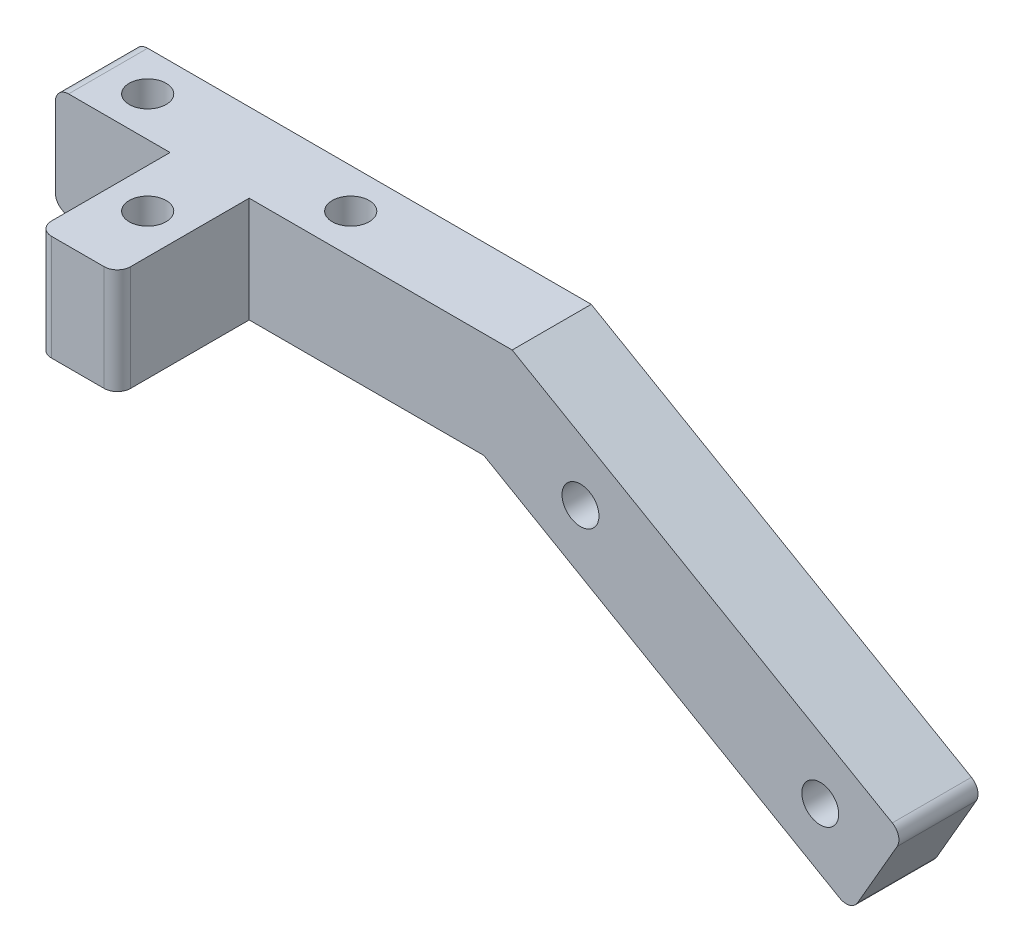
ISO-10303-21;
HEADER;
FILE_DESCRIPTION(('STEP AP214'),'2;1');
FILE_NAME('part.step','',(''),(''),'','','');
FILE_SCHEMA(('AUTOMOTIVE_DESIGN { 1 0 10303 214 1 1 1 1 }'));
ENDSEC;
DATA;
#1=APPLICATION_CONTEXT('core data for automotive mechanical design processes');
#2=APPLICATION_PROTOCOL_DEFINITION('international standard','automotive_design',2000,#1);
#3=PRODUCT_CONTEXT('',#1,'mechanical');
#4=PRODUCT('Part','Part','',(#3));
#5=PRODUCT_RELATED_PRODUCT_CATEGORY('part','',(#4));
#6=PRODUCT_DEFINITION_FORMATION('','',#4);
#7=PRODUCT_DEFINITION_CONTEXT('part definition',#1,'design');
#8=PRODUCT_DEFINITION('design','',#6,#7);
#9=PRODUCT_DEFINITION_SHAPE('','',#8);
#10=(LENGTH_UNIT() NAMED_UNIT(*) SI_UNIT(.MILLI.,.METRE.));
#11=(NAMED_UNIT(*) PLANE_ANGLE_UNIT() SI_UNIT($,.RADIAN.));
#12=(NAMED_UNIT(*) SI_UNIT($,.STERADIAN.) SOLID_ANGLE_UNIT());
#13=UNCERTAINTY_MEASURE_WITH_UNIT(LENGTH_MEASURE(1.E-05),#10,'distance_accuracy_value','');
#14=(GEOMETRIC_REPRESENTATION_CONTEXT(3) GLOBAL_UNCERTAINTY_ASSIGNED_CONTEXT((#13)) GLOBAL_UNIT_ASSIGNED_CONTEXT((#10,
#11,#12)) REPRESENTATION_CONTEXT('',''));
#15=CARTESIAN_POINT('',(0.,0.,0.));
#16=DIRECTION('',(0.,0.,1.));
#17=DIRECTION('',(1.,0.,0.));
#18=AXIS2_PLACEMENT_3D('',#15,#16,#17);
#19=CARTESIAN_POINT('',(0.,0.,7.62));
#20=DIRECTION('',(0.,0.,-1.));
#21=DIRECTION('',(-1.,0.,0.));
#22=AXIS2_PLACEMENT_3D('',#19,#20,#21);
#23=PLANE('',#22);
#24=CARTESIAN_POINT('',(50.5786359259566,0.494422028673305,7.62));
#25=DIRECTION('',(0.,0.,1.));
#26=DIRECTION('',(1.,0.,0.));
#27=AXIS2_PLACEMENT_3D('',#24,#25,#26);
#28=CIRCLE('',#27,1.778);
#29=CARTESIAN_POINT('',(52.3566359259566,0.494422028673305,7.62));
#30=VERTEX_POINT('',#29);
#31=EDGE_CURVE('E197',#30,#30,#28,.T.);
#32=ORIENTED_EDGE('',*,*,#31,.F.);
#33=EDGE_LOOP('',(#32));
#34=FACE_BOUND('',#33,.T.);
#35=CARTESIAN_POINT('',(73.6755334448875,-12.8405779713267,7.62));
#36=DIRECTION('',(0.,0.,1.));
#37=DIRECTION('',(1.,0.,0.));
#38=AXIS2_PLACEMENT_3D('',#35,#36,#37);
#39=CIRCLE('',#38,1.77800000000001);
#40=CARTESIAN_POINT('',(75.4535334448875,-12.8405779713267,7.62));
#41=VERTEX_POINT('',#40);
#42=EDGE_CURVE('E453',#41,#41,#39,.T.);
#43=ORIENTED_EDGE('',*,*,#42,.F.);
#44=EDGE_LOOP('',(#43));
#45=FACE_BOUND('',#44,.T.);
#46=DIRECTION('',(0.5,0.866025403784438,0.));
#47=VECTOR('',#46,1.);
#48=CARTESIAN_POINT('',(81.7147947589187,-11.6161689201018,7.62));
#49=LINE('',#48,#47);
#50=CARTESIAN_POINT('',(77.2697947589187,-19.3151347597454,7.62));
#51=VERTEX_POINT('',#50);
#52=CARTESIAN_POINT('',(81.0797947589187,-12.716021182908,7.62));
#53=VERTEX_POINT('',#52);
#54=EDGE_CURVE('E184',#51,#53,#49,.T.);
#55=ORIENTED_EDGE('',*,*,#54,.T.);
#56=CARTESIAN_POINT('',(79.9799424961125,-12.081021182908,7.62));
#57=DIRECTION('',(0.,0.,-1.));
#58=DIRECTION('',(-1.,0.,0.));
#59=AXIS2_PLACEMENT_3D('',#56,#57,#58);
#60=CIRCLE('',#59,1.27);
#61=CARTESIAN_POINT('',(80.6149424961124,-10.9811689201018,7.62));
#62=VERTEX_POINT('',#61);
#63=EDGE_CURVE('E41',#53,#62,#60,.F.);
#64=ORIENTED_EDGE('',*,*,#63,.T.);
#65=DIRECTION('',(-0.866025403784438,0.500000000000001,0.));
#66=VECTOR('',#65,1.);
#67=CARTESIAN_POINT('',(43.9973637951002,10.16,7.62));
#68=LINE('',#67,#66);
#69=CARTESIAN_POINT('',(43.9973637951002,10.16,7.62));
#70=VERTEX_POINT('',#69);
#71=EDGE_CURVE('E186',#62,#70,#68,.T.);
#72=ORIENTED_EDGE('',*,*,#71,.T.);
#73=DIRECTION('',(-1.,0.,0.));
#74=VECTOR('',#73,1.);
#75=CARTESIAN_POINT('',(0.,10.16,7.62));
#76=LINE('',#75,#74);
#77=CARTESIAN_POINT('',(18.669,10.16,7.62));
#78=VERTEX_POINT('',#77);
#79=EDGE_CURVE('E164',#70,#78,#76,.T.);
#80=ORIENTED_EDGE('',*,*,#79,.T.);
#81=DIRECTION('',(0.,1.,0.));
#82=VECTOR('',#81,1.);
#83=CARTESIAN_POINT('',(18.669,0.,7.62));
#84=LINE('',#83,#82);
#85=CARTESIAN_POINT('',(18.669,0.,7.62));
#86=VERTEX_POINT('',#85);
#87=EDGE_CURVE('E152',#86,#78,#84,.T.);
#88=ORIENTED_EDGE('',*,*,#87,.F.);
#89=DIRECTION('',(1.,0.,0.));
#90=VECTOR('',#89,1.);
#91=CARTESIAN_POINT('',(41.275,0.,7.62));
#92=LINE('',#91,#90);
#93=CARTESIAN_POINT('',(41.275,0.,7.62));
#94=VERTEX_POINT('',#93);
#95=EDGE_CURVE('E162',#86,#94,#92,.T.);
#96=ORIENTED_EDGE('',*,*,#95,.T.);
#97=DIRECTION('',(0.866025403784438,-0.500000000000001,0.));
#98=VECTOR('',#97,1.);
#99=CARTESIAN_POINT('',(76.6347947589187,-20.4149870225517,7.62));
#100=LINE('',#99,#98);
#101=CARTESIAN_POINT('',(75.5349424961124,-19.7799870225517,7.62));
#102=VERTEX_POINT('',#101);
#103=EDGE_CURVE('E175',#94,#102,#100,.T.);
#104=ORIENTED_EDGE('',*,*,#103,.T.);
#105=CARTESIAN_POINT('',(76.1699424961124,-18.6801347597454,7.62));
#106=DIRECTION('',(0.,0.,-1.));
#107=DIRECTION('',(-1.,0.,0.));
#108=AXIS2_PLACEMENT_3D('',#105,#106,#107);
#109=CIRCLE('',#108,1.27);
#110=EDGE_CURVE('E254',#102,#51,#109,.F.);
#111=ORIENTED_EDGE('',*,*,#110,.T.);
#112=EDGE_LOOP('',(#55,#64,#72,#80,#88,#96,#104,#111));
#113=FACE_BOUND('',#112,.T.);
#114=ADVANCED_FACE('F33',(#34,#45,#113),#23,.F.);
#115=CARTESIAN_POINT('',(11.049,10.16,7.62));
#116=VERTEX_POINT('',#115);
#117=CARTESIAN_POINT('',(1.27,10.16,7.62));
#118=VERTEX_POINT('',#117);
#119=EDGE_CURVE('E188',#116,#118,#76,.T.);
#120=ORIENTED_EDGE('',*,*,#119,.T.);
#121=CARTESIAN_POINT('',(1.27,8.89,7.62));
#122=DIRECTION('',(0.,0.,-1.));
#123=DIRECTION('',(-1.,0.,0.));
#124=AXIS2_PLACEMENT_3D('',#121,#122,#123);
#125=CIRCLE('',#124,1.27);
#126=CARTESIAN_POINT('',(0.,8.89,7.62));
#127=VERTEX_POINT('',#126);
#128=EDGE_CURVE('E245',#118,#127,#125,.F.);
#129=ORIENTED_EDGE('',*,*,#128,.T.);
#130=DIRECTION('',(0.,-1.,0.));
#131=VECTOR('',#130,1.);
#132=CARTESIAN_POINT('',(0.,0.,7.62));
#133=LINE('',#132,#131);
#134=CARTESIAN_POINT('',(0.,1.27,7.62));
#135=VERTEX_POINT('',#134);
#136=EDGE_CURVE('E190',#127,#135,#133,.T.);
#137=ORIENTED_EDGE('',*,*,#136,.T.);
#138=CARTESIAN_POINT('',(1.27000000000001,1.27,7.62));
#139=DIRECTION('',(0.,0.,-1.));
#140=DIRECTION('',(-1.,0.,0.));
#141=AXIS2_PLACEMENT_3D('',#138,#139,#140);
#142=CIRCLE('',#141,1.27);
#143=CARTESIAN_POINT('',(1.27000000000001,0.,7.62));
#144=VERTEX_POINT('',#143);
#145=EDGE_CURVE('E243',#135,#144,#142,.F.);
#146=ORIENTED_EDGE('',*,*,#145,.T.);
#147=CARTESIAN_POINT('',(11.049,0.,7.62));
#148=VERTEX_POINT('',#147);
#149=EDGE_CURVE('E172',#144,#148,#92,.T.);
#150=ORIENTED_EDGE('',*,*,#149,.T.);
#151=DIRECTION('',(0.,1.,0.));
#152=VECTOR('',#151,1.);
#153=CARTESIAN_POINT('',(11.049,0.,7.62));
#154=LINE('',#153,#152);
#155=EDGE_CURVE('E165',#148,#116,#154,.T.);
#156=ORIENTED_EDGE('',*,*,#155,.T.);
#157=EDGE_LOOP('',(#120,#129,#137,#146,#150,#156));
#158=FACE_BOUND('',#157,.T.);
#159=ADVANCED_FACE('F288',(#158),#23,.F.);
#160=CARTESIAN_POINT('',(0.,0.,0.));
#161=DIRECTION('',(0.,0.,-1.));
#162=DIRECTION('',(-1.,0.,0.));
#163=AXIS2_PLACEMENT_3D('',#160,#161,#162);
#164=PLANE('',#163);
#165=CARTESIAN_POINT('',(50.5786359259566,0.494422028673305,0.));
#166=DIRECTION('',(0.,0.,1.));
#167=DIRECTION('',(1.,0.,0.));
#168=AXIS2_PLACEMENT_3D('',#165,#166,#167);
#169=CIRCLE('',#168,1.778);
#170=CARTESIAN_POINT('',(52.3566359259566,0.494422028673305,0.));
#171=VERTEX_POINT('',#170);
#172=EDGE_CURVE('E181',#171,#171,#169,.T.);
#173=ORIENTED_EDGE('',*,*,#172,.T.);
#174=EDGE_LOOP('',(#173));
#175=FACE_BOUND('',#174,.T.);
#176=DIRECTION('',(0.,-1.,0.));
#177=VECTOR('',#176,1.);
#178=CARTESIAN_POINT('',(0.,0.,0.));
#179=LINE('',#178,#177);
#180=CARTESIAN_POINT('',(0.,8.89,0.));
#181=VERTEX_POINT('',#180);
#182=CARTESIAN_POINT('',(0.,1.27,0.));
#183=VERTEX_POINT('',#182);
#184=EDGE_CURVE('E173',#181,#183,#179,.T.);
#185=ORIENTED_EDGE('',*,*,#184,.F.);
#186=CARTESIAN_POINT('',(1.27,8.89,0.));
#187=DIRECTION('',(0.,0.,-1.));
#188=DIRECTION('',(-1.,0.,0.));
#189=AXIS2_PLACEMENT_3D('',#186,#187,#188);
#190=CIRCLE('',#189,1.27);
#191=CARTESIAN_POINT('',(1.27,10.16,0.));
#192=VERTEX_POINT('',#191);
#193=EDGE_CURVE('E241',#181,#192,#190,.T.);
#194=ORIENTED_EDGE('',*,*,#193,.T.);
#195=DIRECTION('',(-1.,0.,0.));
#196=VECTOR('',#195,1.);
#197=CARTESIAN_POINT('',(0.,10.16,0.));
#198=LINE('',#197,#196);
#199=CARTESIAN_POINT('',(43.9973637951002,10.16,0.));
#200=VERTEX_POINT('',#199);
#201=EDGE_CURVE('E177',#200,#192,#198,.T.);
#202=ORIENTED_EDGE('',*,*,#201,.F.);
#203=DIRECTION('',(-0.866025403784438,0.500000000000001,0.));
#204=VECTOR('',#203,1.);
#205=CARTESIAN_POINT('',(43.9973637951002,10.16,0.));
#206=LINE('',#205,#204);
#207=CARTESIAN_POINT('',(80.6149424961124,-10.9811689201018,0.));
#208=VERTEX_POINT('',#207);
#209=EDGE_CURVE('E201',#208,#200,#206,.T.);
#210=ORIENTED_EDGE('',*,*,#209,.F.);
#211=CARTESIAN_POINT('',(79.9799424961125,-12.081021182908,0.));
#212=DIRECTION('',(0.,0.,-1.));
#213=DIRECTION('',(-1.,0.,0.));
#214=AXIS2_PLACEMENT_3D('',#211,#212,#213);
#215=CIRCLE('',#214,1.27);
#216=CARTESIAN_POINT('',(81.0797947589187,-12.716021182908,0.));
#217=VERTEX_POINT('',#216);
#218=EDGE_CURVE('E239',#208,#217,#215,.T.);
#219=ORIENTED_EDGE('',*,*,#218,.T.);
#220=DIRECTION('',(0.5,0.866025403784438,0.));
#221=VECTOR('',#220,1.);
#222=CARTESIAN_POINT('',(81.7147947589187,-11.6161689201018,0.));
#223=LINE('',#222,#221);
#224=CARTESIAN_POINT('',(77.2697947589187,-19.3151347597454,0.));
#225=VERTEX_POINT('',#224);
#226=EDGE_CURVE('E199',#225,#217,#223,.T.);
#227=ORIENTED_EDGE('',*,*,#226,.F.);
#228=CARTESIAN_POINT('',(76.1699424961124,-18.6801347597454,0.));
#229=DIRECTION('',(0.,0.,-1.));
#230=DIRECTION('',(-1.,0.,0.));
#231=AXIS2_PLACEMENT_3D('',#228,#229,#230);
#232=CIRCLE('',#231,1.27);
#233=CARTESIAN_POINT('',(75.5349424961124,-19.7799870225517,0.));
#234=VERTEX_POINT('',#233);
#235=EDGE_CURVE('E237',#225,#234,#232,.T.);
#236=ORIENTED_EDGE('',*,*,#235,.T.);
#237=DIRECTION('',(0.866025403784438,-0.500000000000001,0.));
#238=VECTOR('',#237,1.);
#239=CARTESIAN_POINT('',(76.6347947589187,-20.4149870225517,0.));
#240=LINE('',#239,#238);
#241=CARTESIAN_POINT('',(41.275,0.,0.));
#242=VERTEX_POINT('',#241);
#243=EDGE_CURVE('E196',#242,#234,#240,.T.);
#244=ORIENTED_EDGE('',*,*,#243,.F.);
#245=DIRECTION('',(1.,0.,0.));
#246=VECTOR('',#245,1.);
#247=CARTESIAN_POINT('',(41.275,0.,0.));
#248=LINE('',#247,#246);
#249=CARTESIAN_POINT('',(1.27000000000001,0.,0.));
#250=VERTEX_POINT('',#249);
#251=EDGE_CURVE('E194',#250,#242,#248,.T.);
#252=ORIENTED_EDGE('',*,*,#251,.F.);
#253=CARTESIAN_POINT('',(1.27000000000001,1.27,0.));
#254=DIRECTION('',(0.,0.,-1.));
#255=DIRECTION('',(-1.,0.,0.));
#256=AXIS2_PLACEMENT_3D('',#253,#254,#255);
#257=CIRCLE('',#256,1.27);
#258=EDGE_CURVE('E235',#250,#183,#257,.T.);
#259=ORIENTED_EDGE('',*,*,#258,.T.);
#260=EDGE_LOOP('',(#185,#194,#202,#210,#219,#227,#236,#244,#252,#259));
#261=FACE_BOUND('',#260,.T.);
#262=CARTESIAN_POINT('',(73.6755334448875,-12.8405779713267,0.));
#263=DIRECTION('',(0.,0.,1.));
#264=DIRECTION('',(1.,0.,0.));
#265=AXIS2_PLACEMENT_3D('',#262,#263,#264);
#266=CIRCLE('',#265,1.77800000000001);
#267=CARTESIAN_POINT('',(75.4535334448875,-12.8405779713267,0.));
#268=VERTEX_POINT('',#267);
#269=EDGE_CURVE('E444',#268,#268,#266,.T.);
#270=ORIENTED_EDGE('',*,*,#269,.T.);
#271=EDGE_LOOP('',(#270));
#272=FACE_BOUND('',#271,.T.);
#273=ADVANCED_FACE('F267',(#175,#261,#272),#164,.T.);
#274=CARTESIAN_POINT('',(41.275,0.,7.62));
#275=DIRECTION('',(0.,1.,0.));
#276=DIRECTION('',(-1.,0.,0.));
#277=AXIS2_PLACEMENT_3D('',#274,#275,#276);
#278=PLANE('',#277);
#279=CARTESIAN_POINT('',(5.08,0.,3.81));
#280=DIRECTION('',(0.,1.,0.));
#281=DIRECTION('',(-1.,0.,0.));
#282=AXIS2_PLACEMENT_3D('',#279,#280,#281);
#283=CIRCLE('',#282,1.778);
#284=CARTESIAN_POINT('',(3.302,0.,3.81));
#285=VERTEX_POINT('',#284);
#286=EDGE_CURVE('E441',#285,#285,#283,.T.);
#287=ORIENTED_EDGE('',*,*,#286,.T.);
#288=EDGE_LOOP('',(#287));
#289=FACE_BOUND('',#288,.T.);
#290=CARTESIAN_POINT('',(24.638,0.,3.81));
#291=DIRECTION('',(0.,1.,0.));
#292=DIRECTION('',(-1.,0.,0.));
#293=AXIS2_PLACEMENT_3D('',#290,#291,#292);
#294=CIRCLE('',#293,1.778);
#295=CARTESIAN_POINT('',(22.86,0.,3.81));
#296=VERTEX_POINT('',#295);
#297=EDGE_CURVE('E448',#296,#296,#294,.T.);
#298=ORIENTED_EDGE('',*,*,#297,.T.);
#299=EDGE_LOOP('',(#298));
#300=FACE_BOUND('',#299,.T.);
#301=DIRECTION('',(0.,0.,-1.));
#302=VECTOR('',#301,1.);
#303=CARTESIAN_POINT('',(18.669,0.,7.62));
#304=LINE('',#303,#302);
#305=CARTESIAN_POINT('',(18.669,0.,19.05));
#306=VERTEX_POINT('',#305);
#307=EDGE_CURVE('E148',#306,#86,#304,.T.);
#308=ORIENTED_EDGE('',*,*,#307,.F.);
#309=CARTESIAN_POINT('',(17.399,0.,19.05));
#310=DIRECTION('',(0.,1.,0.));
#311=DIRECTION('',(-1.,0.,0.));
#312=AXIS2_PLACEMENT_3D('',#309,#310,#311);
#313=CIRCLE('',#312,1.27);
#314=CARTESIAN_POINT('',(17.399,0.,20.32));
#315=VERTEX_POINT('',#314);
#316=EDGE_CURVE('E225',#306,#315,#313,.F.);
#317=ORIENTED_EDGE('',*,*,#316,.T.);
#318=DIRECTION('',(1.,0.,0.));
#319=VECTOR('',#318,1.);
#320=CARTESIAN_POINT('',(11.049,0.,20.32));
#321=LINE('',#320,#319);
#322=CARTESIAN_POINT('',(12.319,0.,20.32));
#323=VERTEX_POINT('',#322);
#324=EDGE_CURVE('E159',#323,#315,#321,.T.);
#325=ORIENTED_EDGE('',*,*,#324,.F.);
#326=CARTESIAN_POINT('',(12.319,0.,19.05));
#327=DIRECTION('',(0.,1.,0.));
#328=DIRECTION('',(-1.,0.,0.));
#329=AXIS2_PLACEMENT_3D('',#326,#327,#328);
#330=CIRCLE('',#329,1.27);
#331=CARTESIAN_POINT('',(11.049,0.,19.05));
#332=VERTEX_POINT('',#331);
#333=EDGE_CURVE('E223',#323,#332,#330,.F.);
#334=ORIENTED_EDGE('',*,*,#333,.T.);
#335=DIRECTION('',(0.,0.,1.));
#336=VECTOR('',#335,1.);
#337=CARTESIAN_POINT('',(11.049,0.,7.62));
#338=LINE('',#337,#336);
#339=EDGE_CURVE('E419',#148,#332,#338,.T.);
#340=ORIENTED_EDGE('',*,*,#339,.F.);
#341=ORIENTED_EDGE('',*,*,#149,.F.);
#342=DIRECTION('',(0.,0.,-1.));
#343=VECTOR('',#342,1.);
#344=CARTESIAN_POINT('',(1.27000000000001,0.,7.62));
#345=LINE('',#344,#343);
#346=EDGE_CURVE('E220',#144,#250,#345,.T.);
#347=ORIENTED_EDGE('',*,*,#346,.T.);
#348=ORIENTED_EDGE('',*,*,#251,.T.);
#349=DIRECTION('',(0.,0.,-1.));
#350=VECTOR('',#349,1.);
#351=CARTESIAN_POINT('',(41.275,0.,7.62));
#352=LINE('',#351,#350);
#353=EDGE_CURVE('E171',#94,#242,#352,.T.);
#354=ORIENTED_EDGE('',*,*,#353,.F.);
#355=ORIENTED_EDGE('',*,*,#95,.F.);
#356=EDGE_LOOP('',(#308,#317,#325,#334,#340,#341,#347,#348,#354,#355));
#357=FACE_BOUND('',#356,.T.);
#358=CARTESIAN_POINT('',(14.859,0.,13.589));
#359=DIRECTION('',(0.,1.,0.));
#360=DIRECTION('',(-1.,0.,0.));
#361=AXIS2_PLACEMENT_3D('',#358,#359,#360);
#362=CIRCLE('',#361,1.778);
#363=CARTESIAN_POINT('',(13.081,0.,13.589));
#364=VERTEX_POINT('',#363);
#365=EDGE_CURVE('E436',#364,#364,#362,.T.);
#366=ORIENTED_EDGE('',*,*,#365,.T.);
#367=EDGE_LOOP('',(#366));
#368=FACE_BOUND('',#367,.T.);
#369=ADVANCED_FACE('F168',(#289,#300,#357,#368),#278,.F.);
#370=CARTESIAN_POINT('',(76.6347947589187,-20.4149870225517,7.62));
#371=DIRECTION('',(0.500000000000001,0.866025403784438,0.));
#372=DIRECTION('',(-0.866025403784438,0.500000000000001,0.));
#373=AXIS2_PLACEMENT_3D('',#370,#371,#372);
#374=PLANE('',#373);
#375=ORIENTED_EDGE('',*,*,#243,.T.);
#376=DIRECTION('',(0.,0.,-1.));
#377=VECTOR('',#376,1.);
#378=CARTESIAN_POINT('',(75.5349424961124,-19.7799870225517,7.62));
#379=LINE('',#378,#377);
#380=EDGE_CURVE('E11',#234,#102,#379,.F.);
#381=ORIENTED_EDGE('',*,*,#380,.T.);
#382=ORIENTED_EDGE('',*,*,#103,.F.);
#383=ORIENTED_EDGE('',*,*,#353,.T.);
#384=EDGE_LOOP('',(#375,#381,#382,#383));
#385=FACE_BOUND('',#384,.T.);
#386=ADVANCED_FACE('F277',(#385),#374,.F.);
#387=CARTESIAN_POINT('',(81.7147947589187,-11.6161689201018,7.62));
#388=DIRECTION('',(-0.866025403784438,0.5,0.));
#389=DIRECTION('',(-0.5,-0.866025403784438,0.));
#390=AXIS2_PLACEMENT_3D('',#387,#388,#389);
#391=PLANE('',#390);
#392=ORIENTED_EDGE('',*,*,#226,.T.);
#393=DIRECTION('',(0.,0.,-1.));
#394=VECTOR('',#393,1.);
#395=CARTESIAN_POINT('',(81.0797947589187,-12.716021182908,7.62));
#396=LINE('',#395,#394);
#397=EDGE_CURVE('E54',#217,#53,#396,.F.);
#398=ORIENTED_EDGE('',*,*,#397,.T.);
#399=ORIENTED_EDGE('',*,*,#54,.F.);
#400=DIRECTION('',(0.,0.,-1.));
#401=VECTOR('',#400,1.);
#402=CARTESIAN_POINT('',(77.2697947589187,-19.3151347597454,7.62));
#403=LINE('',#402,#401);
#404=EDGE_CURVE('E250',#51,#225,#403,.T.);
#405=ORIENTED_EDGE('',*,*,#404,.T.);
#406=EDGE_LOOP('',(#392,#398,#399,#405));
#407=FACE_BOUND('',#406,.T.);
#408=ADVANCED_FACE('F270',(#407),#391,.F.);
#409=CARTESIAN_POINT('',(43.9973637951002,10.16,7.62));
#410=DIRECTION('',(-0.500000000000001,-0.866025403784438,0.));
#411=DIRECTION('',(0.866025403784438,-0.500000000000001,0.));
#412=AXIS2_PLACEMENT_3D('',#409,#410,#411);
#413=PLANE('',#412);
#414=ORIENTED_EDGE('',*,*,#71,.F.);
#415=DIRECTION('',(0.,0.,-1.));
#416=VECTOR('',#415,1.);
#417=CARTESIAN_POINT('',(80.6149424961124,-10.9811689201018,7.62));
#418=LINE('',#417,#416);
#419=EDGE_CURVE('E247',#62,#208,#418,.T.);
#420=ORIENTED_EDGE('',*,*,#419,.T.);
#421=ORIENTED_EDGE('',*,*,#209,.T.);
#422=DIRECTION('',(0.,0.,-1.));
#423=VECTOR('',#422,1.);
#424=CARTESIAN_POINT('',(43.9973637951002,10.16,7.62));
#425=LINE('',#424,#423);
#426=EDGE_CURVE('E193',#70,#200,#425,.T.);
#427=ORIENTED_EDGE('',*,*,#426,.F.);
#428=EDGE_LOOP('',(#414,#420,#421,#427));
#429=FACE_BOUND('',#428,.T.);
#430=ADVANCED_FACE('F261',(#429),#413,.F.);
#431=CARTESIAN_POINT('',(0.,10.16,7.62));
#432=DIRECTION('',(0.,-1.,0.));
#433=DIRECTION('',(1.,0.,0.));
#434=AXIS2_PLACEMENT_3D('',#431,#432,#433);
#435=PLANE('',#434);
#436=CARTESIAN_POINT('',(5.08,10.16,3.81));
#437=DIRECTION('',(0.,1.,0.));
#438=DIRECTION('',(-1.,0.,0.));
#439=AXIS2_PLACEMENT_3D('',#436,#437,#438);
#440=CIRCLE('',#439,1.778);
#441=CARTESIAN_POINT('',(3.302,10.16,3.81));
#442=VERTEX_POINT('',#441);
#443=EDGE_CURVE('E445',#442,#442,#440,.T.);
#444=ORIENTED_EDGE('',*,*,#443,.F.);
#445=EDGE_LOOP('',(#444));
#446=FACE_BOUND('',#445,.T.);
#447=CARTESIAN_POINT('',(24.638,10.16,3.81));
#448=DIRECTION('',(0.,1.,0.));
#449=DIRECTION('',(-1.,0.,0.));
#450=AXIS2_PLACEMENT_3D('',#447,#448,#449);
#451=CIRCLE('',#450,1.778);
#452=CARTESIAN_POINT('',(22.86,10.16,3.81));
#453=VERTEX_POINT('',#452);
#454=EDGE_CURVE('E439',#453,#453,#451,.T.);
#455=ORIENTED_EDGE('',*,*,#454,.F.);
#456=EDGE_LOOP('',(#455));
#457=FACE_BOUND('',#456,.T.);
#458=DIRECTION('',(1.,0.,0.));
#459=VECTOR('',#458,1.);
#460=CARTESIAN_POINT('',(11.049,10.16,20.32));
#461=LINE('',#460,#459);
#462=CARTESIAN_POINT('',(12.319,10.16,20.32));
#463=VERTEX_POINT('',#462);
#464=CARTESIAN_POINT('',(17.399,10.16,20.32));
#465=VERTEX_POINT('',#464);
#466=EDGE_CURVE('E427',#463,#465,#461,.T.);
#467=ORIENTED_EDGE('',*,*,#466,.T.);
#468=CARTESIAN_POINT('',(17.399,10.16,19.05));
#469=DIRECTION('',(0.,-1.,0.));
#470=DIRECTION('',(1.,0.,0.));
#471=AXIS2_PLACEMENT_3D('',#468,#469,#470);
#472=CIRCLE('',#471,1.27);
#473=CARTESIAN_POINT('',(18.669,10.16,19.05));
#474=VERTEX_POINT('',#473);
#475=EDGE_CURVE('E217',#465,#474,#472,.F.);
#476=ORIENTED_EDGE('',*,*,#475,.T.);
#477=DIRECTION('',(0.,0.,-1.));
#478=VECTOR('',#477,1.);
#479=CARTESIAN_POINT('',(18.669,10.16,7.62));
#480=LINE('',#479,#478);
#481=EDGE_CURVE('E423',#474,#78,#480,.T.);
#482=ORIENTED_EDGE('',*,*,#481,.T.);
#483=ORIENTED_EDGE('',*,*,#79,.F.);
#484=ORIENTED_EDGE('',*,*,#426,.T.);
#485=ORIENTED_EDGE('',*,*,#201,.T.);
#486=DIRECTION('',(0.,0.,-1.));
#487=VECTOR('',#486,1.);
#488=CARTESIAN_POINT('',(1.27,10.16,7.62));
#489=LINE('',#488,#487);
#490=EDGE_CURVE('E213',#192,#118,#489,.F.);
#491=ORIENTED_EDGE('',*,*,#490,.T.);
#492=ORIENTED_EDGE('',*,*,#119,.F.);
#493=DIRECTION('',(0.,0.,1.));
#494=VECTOR('',#493,1.);
#495=CARTESIAN_POINT('',(11.049,10.16,7.62));
#496=LINE('',#495,#494);
#497=CARTESIAN_POINT('',(11.049,10.16,19.05));
#498=VERTEX_POINT('',#497);
#499=EDGE_CURVE('E433',#116,#498,#496,.T.);
#500=ORIENTED_EDGE('',*,*,#499,.T.);
#501=CARTESIAN_POINT('',(12.319,10.16,19.05));
#502=DIRECTION('',(0.,-1.,0.));
#503=DIRECTION('',(1.,0.,0.));
#504=AXIS2_PLACEMENT_3D('',#501,#502,#503);
#505=CIRCLE('',#504,1.27);
#506=EDGE_CURVE('E215',#498,#463,#505,.F.);
#507=ORIENTED_EDGE('',*,*,#506,.T.);
#508=EDGE_LOOP('',(#467,#476,#482,#483,#484,#485,#491,#492,#500,#507));
#509=FACE_BOUND('',#508,.T.);
#510=CARTESIAN_POINT('',(14.859,10.16,13.589));
#511=DIRECTION('',(0.,1.,0.));
#512=DIRECTION('',(-1.,0.,0.));
#513=AXIS2_PLACEMENT_3D('',#510,#511,#512);
#514=CIRCLE('',#513,1.778);
#515=CARTESIAN_POINT('',(13.081,10.16,13.589));
#516=VERTEX_POINT('',#515);
#517=EDGE_CURVE('E430',#516,#516,#514,.T.);
#518=ORIENTED_EDGE('',*,*,#517,.F.);
#519=EDGE_LOOP('',(#518));
#520=FACE_BOUND('',#519,.T.);
#521=ADVANCED_FACE('F308',(#446,#457,#509,#520),#435,.F.);
#522=CARTESIAN_POINT('',(0.,0.,7.62));
#523=DIRECTION('',(1.,0.,0.));
#524=DIRECTION('',(0.,0.,-1.));
#525=AXIS2_PLACEMENT_3D('',#522,#523,#524);
#526=PLANE('',#525);
#527=ORIENTED_EDGE('',*,*,#136,.F.);
#528=DIRECTION('',(0.,0.,-1.));
#529=VECTOR('',#528,1.);
#530=CARTESIAN_POINT('',(0.,8.89,7.62));
#531=LINE('',#530,#529);
#532=EDGE_CURVE('E232',#127,#181,#531,.T.);
#533=ORIENTED_EDGE('',*,*,#532,.T.);
#534=ORIENTED_EDGE('',*,*,#184,.T.);
#535=DIRECTION('',(0.,0.,-1.));
#536=VECTOR('',#535,1.);
#537=CARTESIAN_POINT('',(0.,1.27,7.62));
#538=LINE('',#537,#536);
#539=EDGE_CURVE('E230',#183,#135,#538,.F.);
#540=ORIENTED_EDGE('',*,*,#539,.T.);
#541=EDGE_LOOP('',(#527,#533,#534,#540));
#542=FACE_BOUND('',#541,.T.);
#543=ADVANCED_FACE('F305',(#542),#526,.F.);
#544=CARTESIAN_POINT('',(50.5786359259566,0.494422028673305,7.62));
#545=DIRECTION('',(0.,0.,-1.));
#546=DIRECTION('',(-1.,0.,0.));
#547=AXIS2_PLACEMENT_3D('',#544,#545,#546);
#548=CYLINDRICAL_SURFACE('',#547,1.778);
#549=ORIENTED_EDGE('',*,*,#31,.T.);
#550=EDGE_LOOP('',(#549));
#551=FACE_BOUND('',#550,.T.);
#552=ORIENTED_EDGE('',*,*,#172,.F.);
#553=EDGE_LOOP('',(#552));
#554=FACE_BOUND('',#553,.T.);
#555=ADVANCED_FACE('F300',(#551,#554),#548,.F.);
#556=CARTESIAN_POINT('',(73.6755334448875,-12.8405779713267,7.62));
#557=DIRECTION('',(0.,0.,-1.));
#558=DIRECTION('',(-1.,0.,0.));
#559=AXIS2_PLACEMENT_3D('',#556,#557,#558);
#560=CYLINDRICAL_SURFACE('',#559,1.77800000000001);
#561=ORIENTED_EDGE('',*,*,#42,.T.);
#562=EDGE_LOOP('',(#561));
#563=FACE_BOUND('',#562,.T.);
#564=ORIENTED_EDGE('',*,*,#269,.F.);
#565=EDGE_LOOP('',(#564));
#566=FACE_BOUND('',#565,.T.);
#567=ADVANCED_FACE('F462',(#563,#566),#560,.F.);
#568=CARTESIAN_POINT('',(24.638,0.,3.81));
#569=DIRECTION('',(0.,1.,0.));
#570=DIRECTION('',(-1.,0.,0.));
#571=AXIS2_PLACEMENT_3D('',#568,#569,#570);
#572=CYLINDRICAL_SURFACE('',#571,1.778);
#573=ORIENTED_EDGE('',*,*,#297,.F.);
#574=EDGE_LOOP('',(#573));
#575=FACE_BOUND('',#574,.T.);
#576=ORIENTED_EDGE('',*,*,#454,.T.);
#577=EDGE_LOOP('',(#576));
#578=FACE_BOUND('',#577,.T.);
#579=ADVANCED_FACE('F466',(#575,#578),#572,.F.);
#580=CARTESIAN_POINT('',(5.08,0.,3.81));
#581=DIRECTION('',(0.,1.,0.));
#582=DIRECTION('',(-1.,0.,0.));
#583=AXIS2_PLACEMENT_3D('',#580,#581,#582);
#584=CYLINDRICAL_SURFACE('',#583,1.778);
#585=ORIENTED_EDGE('',*,*,#286,.F.);
#586=EDGE_LOOP('',(#585));
#587=FACE_BOUND('',#586,.T.);
#588=ORIENTED_EDGE('',*,*,#443,.T.);
#589=EDGE_LOOP('',(#588));
#590=FACE_BOUND('',#589,.T.);
#591=ADVANCED_FACE('F334',(#587,#590),#584,.F.);
#592=CARTESIAN_POINT('',(11.049,0.,7.62));
#593=DIRECTION('',(-1.,0.,0.));
#594=DIRECTION('',(0.,-1.,0.));
#595=AXIS2_PLACEMENT_3D('',#592,#593,#594);
#596=PLANE('',#595);
#597=ORIENTED_EDGE('',*,*,#339,.T.);
#598=DIRECTION('',(0.,1.,0.));
#599=VECTOR('',#598,1.);
#600=CARTESIAN_POINT('',(11.049,0.,19.05));
#601=LINE('',#600,#599);
#602=EDGE_CURVE('E227',#332,#498,#601,.T.);
#603=ORIENTED_EDGE('',*,*,#602,.T.);
#604=ORIENTED_EDGE('',*,*,#499,.F.);
#605=ORIENTED_EDGE('',*,*,#155,.F.);
#606=EDGE_LOOP('',(#597,#603,#604,#605));
#607=FACE_BOUND('',#606,.T.);
#608=ADVANCED_FACE('F330',(#607),#596,.T.);
#609=CARTESIAN_POINT('',(18.669,0.,7.62));
#610=DIRECTION('',(1.,0.,0.));
#611=DIRECTION('',(0.,0.,-1.));
#612=AXIS2_PLACEMENT_3D('',#609,#610,#611);
#613=PLANE('',#612);
#614=ORIENTED_EDGE('',*,*,#481,.F.);
#615=DIRECTION('',(0.,1.,0.));
#616=VECTOR('',#615,1.);
#617=CARTESIAN_POINT('',(18.669,0.,19.05));
#618=LINE('',#617,#616);
#619=EDGE_CURVE('E155',#474,#306,#618,.F.);
#620=ORIENTED_EDGE('',*,*,#619,.T.);
#621=ORIENTED_EDGE('',*,*,#307,.T.);
#622=ORIENTED_EDGE('',*,*,#87,.T.);
#623=EDGE_LOOP('',(#614,#620,#621,#622));
#624=FACE_BOUND('',#623,.T.);
#625=ADVANCED_FACE('F151',(#624),#613,.T.);
#626=CARTESIAN_POINT('',(11.049,0.,20.32));
#627=DIRECTION('',(0.,0.,1.));
#628=DIRECTION('',(1.,0.,0.));
#629=AXIS2_PLACEMENT_3D('',#626,#627,#628);
#630=PLANE('',#629);
#631=ORIENTED_EDGE('',*,*,#324,.T.);
#632=DIRECTION('',(0.,1.,0.));
#633=VECTOR('',#632,1.);
#634=CARTESIAN_POINT('',(17.399,0.,20.32));
#635=LINE('',#634,#633);
#636=EDGE_CURVE('E210',#315,#465,#635,.T.);
#637=ORIENTED_EDGE('',*,*,#636,.T.);
#638=ORIENTED_EDGE('',*,*,#466,.F.);
#639=DIRECTION('',(0.,1.,0.));
#640=VECTOR('',#639,1.);
#641=CARTESIAN_POINT('',(12.319,0.,20.32));
#642=LINE('',#641,#640);
#643=EDGE_CURVE('E208',#463,#323,#642,.F.);
#644=ORIENTED_EDGE('',*,*,#643,.T.);
#645=EDGE_LOOP('',(#631,#637,#638,#644));
#646=FACE_BOUND('',#645,.T.);
#647=ADVANCED_FACE('F343',(#646),#630,.T.);
#648=CARTESIAN_POINT('',(14.859,0.,13.589));
#649=DIRECTION('',(0.,1.,0.));
#650=DIRECTION('',(-1.,0.,0.));
#651=AXIS2_PLACEMENT_3D('',#648,#649,#650);
#652=CYLINDRICAL_SURFACE('',#651,1.778);
#653=ORIENTED_EDGE('',*,*,#365,.F.);
#654=EDGE_LOOP('',(#653));
#655=FACE_BOUND('',#654,.T.);
#656=ORIENTED_EDGE('',*,*,#517,.T.);
#657=EDGE_LOOP('',(#656));
#658=FACE_BOUND('',#657,.T.);
#659=ADVANCED_FACE('F350',(#655,#658),#652,.F.);
#660=CARTESIAN_POINT('',(17.399,0.,19.05));
#661=DIRECTION('',(0.,1.,0.));
#662=DIRECTION('',(-1.,0.,0.));
#663=AXIS2_PLACEMENT_3D('',#660,#661,#662);
#664=CYLINDRICAL_SURFACE('',#663,1.27);
#665=ORIENTED_EDGE('',*,*,#316,.F.);
#666=ORIENTED_EDGE('',*,*,#619,.F.);
#667=ORIENTED_EDGE('',*,*,#475,.F.);
#668=ORIENTED_EDGE('',*,*,#636,.F.);
#669=EDGE_LOOP('',(#665,#666,#667,#668));
#670=FACE_BOUND('',#669,.T.);
#671=ADVANCED_FACE('F356',(#670),#664,.T.);
#672=CARTESIAN_POINT('',(12.319,0.,19.05));
#673=DIRECTION('',(0.,1.,0.));
#674=DIRECTION('',(-1.,0.,0.));
#675=AXIS2_PLACEMENT_3D('',#672,#673,#674);
#676=CYLINDRICAL_SURFACE('',#675,1.27);
#677=ORIENTED_EDGE('',*,*,#333,.F.);
#678=ORIENTED_EDGE('',*,*,#643,.F.);
#679=ORIENTED_EDGE('',*,*,#506,.F.);
#680=ORIENTED_EDGE('',*,*,#602,.F.);
#681=EDGE_LOOP('',(#677,#678,#679,#680));
#682=FACE_BOUND('',#681,.T.);
#683=ADVANCED_FACE('F361',(#682),#676,.T.);
#684=CARTESIAN_POINT('',(1.27,8.89,7.62));
#685=DIRECTION('',(0.,0.,-1.));
#686=DIRECTION('',(-1.,0.,0.));
#687=AXIS2_PLACEMENT_3D('',#684,#685,#686);
#688=CYLINDRICAL_SURFACE('',#687,1.27);
#689=ORIENTED_EDGE('',*,*,#128,.F.);
#690=ORIENTED_EDGE('',*,*,#490,.F.);
#691=ORIENTED_EDGE('',*,*,#193,.F.);
#692=ORIENTED_EDGE('',*,*,#532,.F.);
#693=EDGE_LOOP('',(#689,#690,#691,#692));
#694=FACE_BOUND('',#693,.T.);
#695=ADVANCED_FACE('F372',(#694),#688,.T.);
#696=CARTESIAN_POINT('',(79.9799424961125,-12.081021182908,7.62));
#697=DIRECTION('',(0.,0.,-1.));
#698=DIRECTION('',(-1.,0.,0.));
#699=AXIS2_PLACEMENT_3D('',#696,#697,#698);
#700=CYLINDRICAL_SURFACE('',#699,1.27);
#701=ORIENTED_EDGE('',*,*,#63,.F.);
#702=ORIENTED_EDGE('',*,*,#397,.F.);
#703=ORIENTED_EDGE('',*,*,#218,.F.);
#704=ORIENTED_EDGE('',*,*,#419,.F.);
#705=EDGE_LOOP('',(#701,#702,#703,#704));
#706=FACE_BOUND('',#705,.T.);
#707=ADVANCED_FACE('F263',(#706),#700,.T.);
#708=CARTESIAN_POINT('',(76.1699424961124,-18.6801347597454,7.62));
#709=DIRECTION('',(0.,0.,-1.));
#710=DIRECTION('',(-1.,0.,0.));
#711=AXIS2_PLACEMENT_3D('',#708,#709,#710);
#712=CYLINDRICAL_SURFACE('',#711,1.27);
#713=ORIENTED_EDGE('',*,*,#110,.F.);
#714=ORIENTED_EDGE('',*,*,#380,.F.);
#715=ORIENTED_EDGE('',*,*,#235,.F.);
#716=ORIENTED_EDGE('',*,*,#404,.F.);
#717=EDGE_LOOP('',(#713,#714,#715,#716));
#718=FACE_BOUND('',#717,.T.);
#719=ADVANCED_FACE('F274',(#718),#712,.T.);
#720=CARTESIAN_POINT('',(1.27000000000001,1.27,7.62));
#721=DIRECTION('',(0.,0.,-1.));
#722=DIRECTION('',(-1.,0.,0.));
#723=AXIS2_PLACEMENT_3D('',#720,#721,#722);
#724=CYLINDRICAL_SURFACE('',#723,1.27);
#725=ORIENTED_EDGE('',*,*,#145,.F.);
#726=ORIENTED_EDGE('',*,*,#539,.F.);
#727=ORIENTED_EDGE('',*,*,#258,.F.);
#728=ORIENTED_EDGE('',*,*,#346,.F.);
#729=EDGE_LOOP('',(#725,#726,#727,#728));
#730=FACE_BOUND('',#729,.T.);
#731=ADVANCED_FACE('F35',(#730),#724,.T.);
#732=CLOSED_SHELL('',(#114,#159,#273,#369,#386,#408,#430,#521,#543,#555,#567,#579,#591,#608,
#625,#647,#659,#671,#683,#695,#707,#719,#731));
#733=MANIFOLD_SOLID_BREP('B2',#732);
#734=ADVANCED_BREP_SHAPE_REPRESENTATION('',(#18,#733),#14);
#735=SHAPE_DEFINITION_REPRESENTATION(#9,#734);
ENDSEC;
END-ISO-10303-21;
